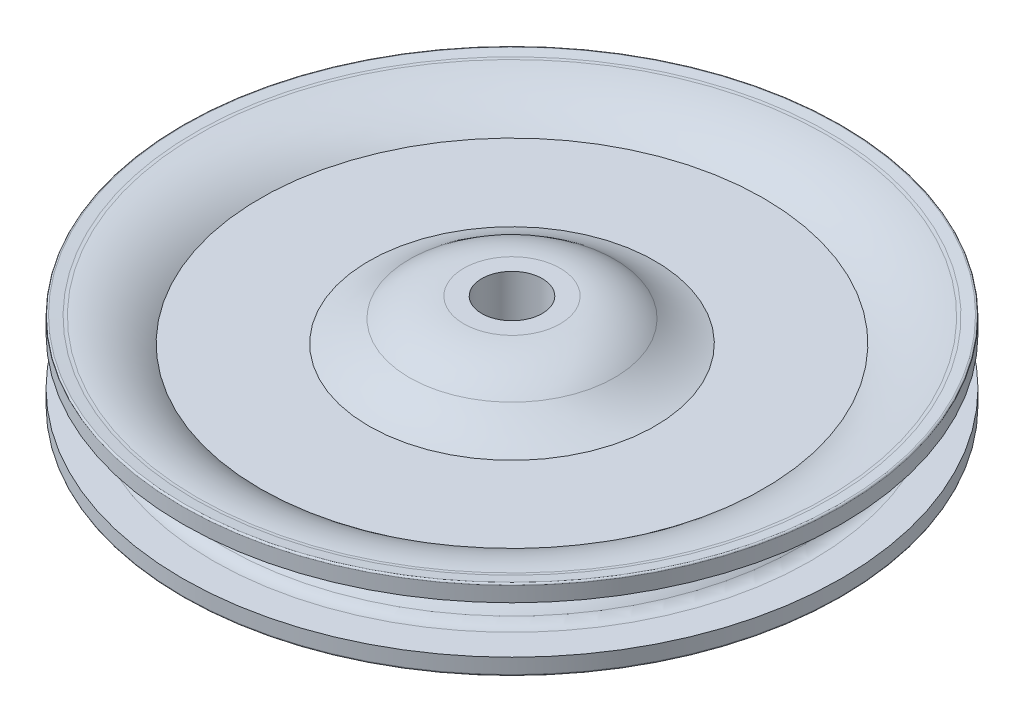
ISO-10303-21;
HEADER;
FILE_DESCRIPTION(('STEP AP214'),'2;1');
FILE_NAME('part.step','',(''),(''),'','','');
FILE_SCHEMA(('AUTOMOTIVE_DESIGN { 1 0 10303 214 1 1 1 1 }'));
ENDSEC;
DATA;
#1=APPLICATION_CONTEXT('core data for automotive mechanical design processes');
#2=APPLICATION_PROTOCOL_DEFINITION('international standard','automotive_design',2000,#1);
#3=PRODUCT_CONTEXT('',#1,'mechanical');
#4=PRODUCT('Part','Part','',(#3));
#5=PRODUCT_RELATED_PRODUCT_CATEGORY('part','',(#4));
#6=PRODUCT_DEFINITION_FORMATION('','',#4);
#7=PRODUCT_DEFINITION_CONTEXT('part definition',#1,'design');
#8=PRODUCT_DEFINITION('design','',#6,#7);
#9=PRODUCT_DEFINITION_SHAPE('','',#8);
#10=(LENGTH_UNIT() NAMED_UNIT(*) SI_UNIT(.MILLI.,.METRE.));
#11=(NAMED_UNIT(*) PLANE_ANGLE_UNIT() SI_UNIT($,.RADIAN.));
#12=(NAMED_UNIT(*) SI_UNIT($,.STERADIAN.) SOLID_ANGLE_UNIT());
#13=UNCERTAINTY_MEASURE_WITH_UNIT(LENGTH_MEASURE(1.E-05),#10,'distance_accuracy_value','');
#14=(GEOMETRIC_REPRESENTATION_CONTEXT(3) GLOBAL_UNCERTAINTY_ASSIGNED_CONTEXT((#13)) GLOBAL_UNIT_ASSIGNED_CONTEXT((#10,
#11,#12)) REPRESENTATION_CONTEXT('',''));
#15=CARTESIAN_POINT('',(0.,0.,0.));
#16=DIRECTION('',(0.,0.,1.));
#17=DIRECTION('',(1.,0.,0.));
#18=AXIS2_PLACEMENT_3D('',#15,#16,#17);
#19=CARTESIAN_POINT('',(0.,4.86042079778806,0.));
#20=DIRECTION('',(0.,1.,0.));
#21=DIRECTION('',(0.,0.,1.));
#22=AXIS2_PLACEMENT_3D('',#19,#20,#21);
#23=DEGENERATE_TOROIDAL_SURFACE('',#22,7.89305000000001,14.0742707977881,.T.);
#24=CARTESIAN_POINT('',(0.,-6.03517127364018,0.));
#25=DIRECTION('',(0.,1.,0.));
#26=DIRECTION('',(0.,0.,1.));
#27=AXIS2_PLACEMENT_3D('',#24,#25,#26);
#28=CIRCLE('',#27,16.8021);
#29=CARTESIAN_POINT('',(0.,-6.03517127364018,16.8021));
#30=VERTEX_POINT('',#29);
#31=EDGE_CURVE('E10',#30,#30,#28,.T.);
#32=ORIENTED_EDGE('',*,*,#31,.F.);
#33=EDGE_LOOP('',(#32));
#34=FACE_BOUND('',#33,.T.);
#35=CARTESIAN_POINT('',(0.,-9.21385,0.));
#36=DIRECTION('',(0.,1.,0.));
#37=DIRECTION('',(0.,0.,1.));
#38=AXIS2_PLACEMENT_3D('',#35,#36,#37);
#39=CIRCLE('',#38,7.89305000000001);
#40=CARTESIAN_POINT('',(0.,-9.21385,7.89305000000001));
#41=VERTEX_POINT('',#40);
#42=EDGE_CURVE('E106',#41,#41,#39,.T.);
#43=ORIENTED_EDGE('',*,*,#42,.T.);
#44=EDGE_LOOP('',(#43));
#45=FACE_BOUND('',#44,.T.);
#46=ADVANCED_FACE('F30',(#34,#45),#23,.T.);
#47=CARTESIAN_POINT('',(0.,-21.2372215088753,0.));
#48=DIRECTION('',(0.,1.,0.));
#49=DIRECTION('',(0.,0.,1.));
#50=AXIS2_PLACEMENT_3D('',#47,#48,#49);
#51=TOROIDAL_SURFACE('',#50,29.2324318957194,19.6370945506801);
#52=CARTESIAN_POINT('',(0.,-2.4765,0.));
#53=DIRECTION('',(0.,1.,0.));
#54=DIRECTION('',(0.,0.,1.));
#55=AXIS2_PLACEMENT_3D('',#52,#53,#54);
#56=CIRCLE('',#55,23.4315);
#57=CARTESIAN_POINT('',(0.,-2.4765,23.4315));
#58=VERTEX_POINT('',#57);
#59=EDGE_CURVE('E36',#58,#58,#56,.T.);
#60=ORIENTED_EDGE('',*,*,#59,.F.);
#61=EDGE_LOOP('',(#60));
#62=FACE_BOUND('',#61,.T.);
#63=ORIENTED_EDGE('',*,*,#31,.T.);
#64=EDGE_LOOP('',(#63));
#65=FACE_BOUND('',#64,.T.);
#66=ADVANCED_FACE('F239',(#62,#65),#51,.F.);
#67=CARTESIAN_POINT('',(23.4315,-2.4765,0.));
#68=DIRECTION('',(0.,1.,0.));
#69=DIRECTION('',(0.,0.,1.));
#70=AXIS2_PLACEMENT_3D('',#67,#68,#69);
#71=PLANE('',#70);
#72=CARTESIAN_POINT('',(0.,-2.47650000000001,0.));
#73=DIRECTION('',(0.,1.,0.));
#74=DIRECTION('',(0.,0.,1.));
#75=AXIS2_PLACEMENT_3D('',#72,#73,#74);
#76=CIRCLE('',#75,41.2115);
#77=CARTESIAN_POINT('',(0.,-2.47650000000001,41.2115));
#78=VERTEX_POINT('',#77);
#79=EDGE_CURVE('E40',#78,#78,#76,.T.);
#80=ORIENTED_EDGE('',*,*,#79,.F.);
#81=EDGE_LOOP('',(#80));
#82=FACE_BOUND('',#81,.T.);
#83=ORIENTED_EDGE('',*,*,#59,.T.);
#84=EDGE_LOOP('',(#83));
#85=FACE_BOUND('',#84,.T.);
#86=ADVANCED_FACE('F234',(#82,#85),#71,.F.);
#87=CARTESIAN_POINT('',(0.,9.86038409836064,0.));
#88=DIRECTION('',(0.,1.,0.));
#89=DIRECTION('',(0.,0.,1.));
#90=AXIS2_PLACEMENT_3D('',#87,#88,#89);
#91=TOROIDAL_SURFACE('',#90,51.7271,16.2103840983606);
#92=CARTESIAN_POINT('',(0.,-6.35,0.));
#93=DIRECTION('',(0.,1.,0.));
#94=DIRECTION('',(0.,0.,1.));
#95=AXIS2_PLACEMENT_3D('',#92,#93,#94);
#96=CIRCLE('',#95,51.7271);
#97=CARTESIAN_POINT('',(0.,-6.35,51.7271));
#98=VERTEX_POINT('',#97);
#99=EDGE_CURVE('E44',#98,#98,#96,.T.);
#100=ORIENTED_EDGE('',*,*,#99,.F.);
#101=EDGE_LOOP('',(#100));
#102=FACE_BOUND('',#101,.T.);
#103=ORIENTED_EDGE('',*,*,#79,.T.);
#104=EDGE_LOOP('',(#103));
#105=FACE_BOUND('',#104,.T.);
#106=ADVANCED_FACE('F228',(#102,#105),#91,.T.);
#107=CARTESIAN_POINT('',(0.,-6.35,0.));
#108=DIRECTION('',(0.,-1.,0.));
#109=DIRECTION('',(0.,0.,-1.));
#110=AXIS2_PLACEMENT_3D('',#107,#108,#109);
#111=CONICAL_SURFACE('',#110,51.7271,1.45764534520441);
#112=CARTESIAN_POINT('',(0.,-6.57187737945872,0.));
#113=DIRECTION('',(0.,1.,0.));
#114=DIRECTION('',(0.,0.,1.));
#115=AXIS2_PLACEMENT_3D('',#112,#113,#114);
#116=CIRCLE('',#115,53.6796209392367);
#117=CARTESIAN_POINT('',(0.,-6.57187737945872,53.6796209392367));
#118=VERTEX_POINT('',#117);
#119=EDGE_CURVE('E49',#118,#118,#116,.T.);
#120=ORIENTED_EDGE('',*,*,#119,.F.);
#121=EDGE_LOOP('',(#120));
#122=FACE_BOUND('',#121,.T.);
#123=ORIENTED_EDGE('',*,*,#99,.T.);
#124=EDGE_LOOP('',(#123));
#125=FACE_BOUND('',#124,.T.);
#126=ADVANCED_FACE('F222',(#122,#125),#111,.F.);
#127=CARTESIAN_POINT('',(0.,-6.31950164474213,0.));
#128=DIRECTION('',(0.,1.,0.));
#129=DIRECTION('',(0.,0.,1.));
#130=AXIS2_PLACEMENT_3D('',#127,#128,#129);
#131=TOROIDAL_SURFACE('',#130,53.7083,0.253999999999999);
#132=CARTESIAN_POINT('',(0.,-6.31950164474213,0.));
#133=DIRECTION('',(0.,1.,0.));
#134=DIRECTION('',(0.,0.,1.));
#135=AXIS2_PLACEMENT_3D('',#132,#133,#134);
#136=CIRCLE('',#135,53.9623);
#137=CARTESIAN_POINT('',(0.,-6.31950164474213,53.9623));
#138=VERTEX_POINT('',#137);
#139=EDGE_CURVE('E52',#138,#138,#136,.T.);
#140=ORIENTED_EDGE('',*,*,#139,.F.);
#141=EDGE_LOOP('',(#140));
#142=FACE_BOUND('',#141,.T.);
#143=ORIENTED_EDGE('',*,*,#119,.T.);
#144=EDGE_LOOP('',(#143));
#145=FACE_BOUND('',#144,.T.);
#146=ADVANCED_FACE('F216',(#142,#145),#131,.T.);
#147=CARTESIAN_POINT('',(0.,28.5753023809525,0.));
#148=DIRECTION('',(0.,1.,0.));
#149=DIRECTION('',(0.,0.,1.));
#150=AXIS2_PLACEMENT_3D('',#147,#148,#149);
#151=CYLINDRICAL_SURFACE('',#150,53.9623);
#152=CARTESIAN_POINT('',(0.,-3.8608,0.));
#153=DIRECTION('',(0.,1.,0.));
#154=DIRECTION('',(0.,0.,1.));
#155=AXIS2_PLACEMENT_3D('',#152,#153,#154);
#156=CIRCLE('',#155,53.9623);
#157=CARTESIAN_POINT('',(0.,-3.8608,53.9623));
#158=VERTEX_POINT('',#157);
#159=EDGE_CURVE('E55',#158,#158,#156,.T.);
#160=ORIENTED_EDGE('',*,*,#159,.F.);
#161=EDGE_LOOP('',(#160));
#162=FACE_BOUND('',#161,.T.);
#163=ORIENTED_EDGE('',*,*,#139,.T.);
#164=EDGE_LOOP('',(#163));
#165=FACE_BOUND('',#164,.T.);
#166=ADVANCED_FACE('F210',(#162,#165),#151,.T.);
#167=CARTESIAN_POINT('',(48.9656795702502,-3.8608,0.));
#168=DIRECTION('',(0.,-1.,0.));
#169=DIRECTION('',(0.,0.,-1.));
#170=AXIS2_PLACEMENT_3D('',#167,#168,#169);
#171=PLANE('',#170);
#172=CARTESIAN_POINT('',(0.,-3.8608,0.));
#173=DIRECTION('',(0.,1.,0.));
#174=DIRECTION('',(0.,0.,1.));
#175=AXIS2_PLACEMENT_3D('',#172,#173,#174);
#176=CIRCLE('',#175,48.9656795702502);
#177=CARTESIAN_POINT('',(0.,-3.8608,48.9656795702502));
#178=VERTEX_POINT('',#177);
#179=EDGE_CURVE('E58',#178,#178,#176,.T.);
#180=ORIENTED_EDGE('',*,*,#179,.F.);
#181=EDGE_LOOP('',(#180));
#182=FACE_BOUND('',#181,.T.);
#183=ORIENTED_EDGE('',*,*,#159,.T.);
#184=EDGE_LOOP('',(#183));
#185=FACE_BOUND('',#184,.T.);
#186=ADVANCED_FACE('F204',(#182,#185),#171,.F.);
#187=CARTESIAN_POINT('',(0.,-1.3208,0.));
#188=DIRECTION('',(0.,1.,0.));
#189=DIRECTION('',(0.,0.,1.));
#190=AXIS2_PLACEMENT_3D('',#187,#188,#189);
#191=TOROIDAL_SURFACE('',#190,48.9656795702502,2.54);
#192=CARTESIAN_POINT('',(0.,-2.94191473244687,0.));
#193=DIRECTION('',(0.,1.,0.));
#194=DIRECTION('',(0.,0.,1.));
#195=AXIS2_PLACEMENT_3D('',#192,#193,#194);
#196=CIRCLE('',#195,47.0102801163678);
#197=CARTESIAN_POINT('',(0.,-2.94191473244687,47.0102801163678));
#198=VERTEX_POINT('',#197);
#199=EDGE_CURVE('E61',#198,#198,#196,.T.);
#200=ORIENTED_EDGE('',*,*,#199,.F.);
#201=EDGE_LOOP('',(#200));
#202=FACE_BOUND('',#201,.T.);
#203=ORIENTED_EDGE('',*,*,#179,.T.);
#204=EDGE_LOOP('',(#203));
#205=FACE_BOUND('',#204,.T.);
#206=ADVANCED_FACE('F198',(#202,#205),#191,.F.);
#207=CARTESIAN_POINT('',(0.,-11.5986759796967,0.));
#208=DIRECTION('',(0.,1.,0.));
#209=DIRECTION('',(0.,0.,1.));
#210=AXIS2_PLACEMENT_3D('',#207,#208,#209);
#211=TOROIDAL_SURFACE('',#210,36.5684366882268,13.563613437049);
#212=CARTESIAN_POINT('',(0.,0.,0.));
#213=DIRECTION('',(0.,1.,0.));
#214=DIRECTION('',(0.,0.,1.));
#215=AXIS2_PLACEMENT_3D('',#212,#213,#214);
#216=CIRCLE('',#215,43.5999603486936);
#217=CARTESIAN_POINT('',(0.,0.,43.5999603486936));
#218=VERTEX_POINT('',#217);
#219=EDGE_CURVE('E64',#218,#218,#216,.T.);
#220=ORIENTED_EDGE('',*,*,#219,.F.);
#221=EDGE_LOOP('',(#220));
#222=FACE_BOUND('',#221,.T.);
#223=ORIENTED_EDGE('',*,*,#199,.T.);
#224=EDGE_LOOP('',(#223));
#225=FACE_BOUND('',#224,.T.);
#226=ADVANCED_FACE('F192',(#222,#225),#211,.T.);
#227=CARTESIAN_POINT('',(0.,11.5986759796967,0.));
#228=DIRECTION('',(0.,1.,0.));
#229=DIRECTION('',(0.,0.,1.));
#230=AXIS2_PLACEMENT_3D('',#227,#228,#229);
#231=TOROIDAL_SURFACE('',#230,36.5684366882268,13.563613437049);
#232=CARTESIAN_POINT('',(0.,2.94191473244687,0.));
#233=DIRECTION('',(0.,1.,0.));
#234=DIRECTION('',(0.,0.,1.));
#235=AXIS2_PLACEMENT_3D('',#232,#233,#234);
#236=CIRCLE('',#235,47.0102801163678);
#237=CARTESIAN_POINT('',(0.,2.94191473244687,47.0102801163678));
#238=VERTEX_POINT('',#237);
#239=EDGE_CURVE('E67',#238,#238,#236,.T.);
#240=ORIENTED_EDGE('',*,*,#239,.F.);
#241=EDGE_LOOP('',(#240));
#242=FACE_BOUND('',#241,.T.);
#243=ORIENTED_EDGE('',*,*,#219,.T.);
#244=EDGE_LOOP('',(#243));
#245=FACE_BOUND('',#244,.T.);
#246=ADVANCED_FACE('F186',(#242,#245),#231,.T.);
#247=CARTESIAN_POINT('',(0.,1.3208,0.));
#248=DIRECTION('',(0.,1.,0.));
#249=DIRECTION('',(0.,0.,1.));
#250=AXIS2_PLACEMENT_3D('',#247,#248,#249);
#251=TOROIDAL_SURFACE('',#250,48.9656795702502,2.54);
#252=CARTESIAN_POINT('',(0.,3.8608,0.));
#253=DIRECTION('',(0.,1.,0.));
#254=DIRECTION('',(0.,0.,1.));
#255=AXIS2_PLACEMENT_3D('',#252,#253,#254);
#256=CIRCLE('',#255,48.9656795702502);
#257=CARTESIAN_POINT('',(0.,3.8608,48.9656795702502));
#258=VERTEX_POINT('',#257);
#259=EDGE_CURVE('E70',#258,#258,#256,.T.);
#260=ORIENTED_EDGE('',*,*,#259,.F.);
#261=EDGE_LOOP('',(#260));
#262=FACE_BOUND('',#261,.T.);
#263=ORIENTED_EDGE('',*,*,#239,.T.);
#264=EDGE_LOOP('',(#263));
#265=FACE_BOUND('',#264,.T.);
#266=ADVANCED_FACE('F180',(#262,#265),#251,.F.);
#267=CARTESIAN_POINT('',(53.9623,3.8608,0.));
#268=DIRECTION('',(0.,1.,0.));
#269=DIRECTION('',(0.,0.,1.));
#270=AXIS2_PLACEMENT_3D('',#267,#268,#269);
#271=PLANE('',#270);
#272=CARTESIAN_POINT('',(0.,3.8608,0.));
#273=DIRECTION('',(0.,1.,0.));
#274=DIRECTION('',(0.,0.,1.));
#275=AXIS2_PLACEMENT_3D('',#272,#273,#274);
#276=CIRCLE('',#275,53.9623);
#277=CARTESIAN_POINT('',(0.,3.8608,53.9623));
#278=VERTEX_POINT('',#277);
#279=EDGE_CURVE('E73',#278,#278,#276,.T.);
#280=ORIENTED_EDGE('',*,*,#279,.F.);
#281=EDGE_LOOP('',(#280));
#282=FACE_BOUND('',#281,.T.);
#283=ORIENTED_EDGE('',*,*,#259,.T.);
#284=EDGE_LOOP('',(#283));
#285=FACE_BOUND('',#284,.T.);
#286=ADVANCED_FACE('F174',(#282,#285),#271,.F.);
#287=CARTESIAN_POINT('',(0.,28.5753023809525,0.));
#288=DIRECTION('',(0.,1.,0.));
#289=DIRECTION('',(0.,0.,1.));
#290=AXIS2_PLACEMENT_3D('',#287,#288,#289);
#291=CYLINDRICAL_SURFACE('',#290,53.9623);
#292=CARTESIAN_POINT('',(0.,6.31950164474213,0.));
#293=DIRECTION('',(0.,1.,0.));
#294=DIRECTION('',(0.,0.,1.));
#295=AXIS2_PLACEMENT_3D('',#292,#293,#294);
#296=CIRCLE('',#295,53.9623);
#297=CARTESIAN_POINT('',(0.,6.31950164474213,53.9623));
#298=VERTEX_POINT('',#297);
#299=EDGE_CURVE('E76',#298,#298,#296,.T.);
#300=ORIENTED_EDGE('',*,*,#299,.F.);
#301=EDGE_LOOP('',(#300));
#302=FACE_BOUND('',#301,.T.);
#303=ORIENTED_EDGE('',*,*,#279,.T.);
#304=EDGE_LOOP('',(#303));
#305=FACE_BOUND('',#304,.T.);
#306=ADVANCED_FACE('F168',(#302,#305),#291,.T.);
#307=CARTESIAN_POINT('',(0.,6.31950164474213,0.));
#308=DIRECTION('',(0.,1.,0.));
#309=DIRECTION('',(0.,0.,1.));
#310=AXIS2_PLACEMENT_3D('',#307,#308,#309);
#311=TOROIDAL_SURFACE('',#310,53.7083,0.253999999999999);
#312=CARTESIAN_POINT('',(0.,6.57187737945872,0.));
#313=DIRECTION('',(0.,1.,0.));
#314=DIRECTION('',(0.,0.,1.));
#315=AXIS2_PLACEMENT_3D('',#312,#313,#314);
#316=CIRCLE('',#315,53.6796209392367);
#317=CARTESIAN_POINT('',(0.,6.57187737945872,53.6796209392367));
#318=VERTEX_POINT('',#317);
#319=EDGE_CURVE('E79',#318,#318,#316,.T.);
#320=ORIENTED_EDGE('',*,*,#319,.F.);
#321=EDGE_LOOP('',(#320));
#322=FACE_BOUND('',#321,.T.);
#323=ORIENTED_EDGE('',*,*,#299,.T.);
#324=EDGE_LOOP('',(#323));
#325=FACE_BOUND('',#324,.T.);
#326=ADVANCED_FACE('F162',(#322,#325),#311,.T.);
#327=CARTESIAN_POINT('',(0.,6.57187737945872,0.));
#328=DIRECTION('',(0.,1.,0.));
#329=DIRECTION('',(0.,0.,1.));
#330=AXIS2_PLACEMENT_3D('',#327,#328,#329);
#331=CONICAL_SURFACE('',#330,53.6796209392367,1.45764534520441);
#332=CARTESIAN_POINT('',(0.,6.38026864042208,0.));
#333=DIRECTION('',(0.,1.,0.));
#334=DIRECTION('',(0.,0.,1.));
#335=AXIS2_PLACEMENT_3D('',#332,#333,#334);
#336=CIRCLE('',#335,51.9934640357144);
#337=CARTESIAN_POINT('',(0.,6.38026864042208,51.9934640357144));
#338=VERTEX_POINT('',#337);
#339=EDGE_CURVE('E82',#338,#338,#336,.T.);
#340=ORIENTED_EDGE('',*,*,#339,.F.);
#341=EDGE_LOOP('',(#340));
#342=FACE_BOUND('',#341,.T.);
#343=ORIENTED_EDGE('',*,*,#319,.T.);
#344=EDGE_LOOP('',(#343));
#345=FACE_BOUND('',#344,.T.);
#346=ADVANCED_FACE('F156',(#342,#345),#331,.F.);
#347=CARTESIAN_POINT('',(0.,11.4277833347539,0.));
#348=DIRECTION('',(0.,1.,0.));
#349=DIRECTION('',(0.,0.,1.));
#350=AXIS2_PLACEMENT_3D('',#347,#348,#349);
#351=TOROIDAL_SURFACE('',#350,51.4198828204494,5.08);
#352=CARTESIAN_POINT('',(0.,6.34831224298765,0.));
#353=DIRECTION('',(0.,1.,0.));
#354=DIRECTION('',(0.,0.,1.));
#355=AXIS2_PLACEMENT_3D('',#352,#353,#354);
#356=CIRCLE('',#355,51.4931864896038);
#357=CARTESIAN_POINT('',(0.,6.34831224298765,51.4931864896038));
#358=VERTEX_POINT('',#357);
#359=EDGE_CURVE('E85',#358,#358,#356,.T.);
#360=ORIENTED_EDGE('',*,*,#359,.F.);
#361=EDGE_LOOP('',(#360));
#362=FACE_BOUND('',#361,.T.);
#363=ORIENTED_EDGE('',*,*,#339,.T.);
#364=EDGE_LOOP('',(#363));
#365=FACE_BOUND('',#364,.T.);
#366=ADVANCED_FACE('F150',(#362,#365),#351,.F.);
#367=CARTESIAN_POINT('',(0.,-9.86038409836064,0.));
#368=DIRECTION('',(0.,1.,0.));
#369=DIRECTION('',(0.,0.,1.));
#370=AXIS2_PLACEMENT_3D('',#367,#368,#369);
#371=TOROIDAL_SURFACE('',#370,51.7271,16.2103840983606);
#372=CARTESIAN_POINT('',(0.,2.4765,0.));
#373=DIRECTION('',(0.,1.,0.));
#374=DIRECTION('',(0.,0.,1.));
#375=AXIS2_PLACEMENT_3D('',#372,#373,#374);
#376=CIRCLE('',#375,41.2115);
#377=CARTESIAN_POINT('',(0.,2.4765,41.2115));
#378=VERTEX_POINT('',#377);
#379=EDGE_CURVE('E88',#378,#378,#376,.T.);
#380=ORIENTED_EDGE('',*,*,#379,.F.);
#381=EDGE_LOOP('',(#380));
#382=FACE_BOUND('',#381,.T.);
#383=ORIENTED_EDGE('',*,*,#359,.T.);
#384=EDGE_LOOP('',(#383));
#385=FACE_BOUND('',#384,.T.);
#386=ADVANCED_FACE('F144',(#382,#385),#371,.T.);
#387=CARTESIAN_POINT('',(23.4315,2.4765,0.));
#388=DIRECTION('',(0.,-1.,0.));
#389=DIRECTION('',(0.,0.,-1.));
#390=AXIS2_PLACEMENT_3D('',#387,#388,#389);
#391=PLANE('',#390);
#392=CARTESIAN_POINT('',(0.,2.4765,0.));
#393=DIRECTION('',(0.,1.,0.));
#394=DIRECTION('',(0.,0.,1.));
#395=AXIS2_PLACEMENT_3D('',#392,#393,#394);
#396=CIRCLE('',#395,23.4315);
#397=CARTESIAN_POINT('',(0.,2.4765,23.4315));
#398=VERTEX_POINT('',#397);
#399=EDGE_CURVE('E91',#398,#398,#396,.T.);
#400=ORIENTED_EDGE('',*,*,#399,.F.);
#401=EDGE_LOOP('',(#400));
#402=FACE_BOUND('',#401,.T.);
#403=ORIENTED_EDGE('',*,*,#379,.T.);
#404=EDGE_LOOP('',(#403));
#405=FACE_BOUND('',#404,.T.);
#406=ADVANCED_FACE('F138',(#402,#405),#391,.F.);
#407=CARTESIAN_POINT('',(0.,21.2372215088753,0.));
#408=DIRECTION('',(0.,1.,0.));
#409=DIRECTION('',(0.,0.,1.));
#410=AXIS2_PLACEMENT_3D('',#407,#408,#409);
#411=TOROIDAL_SURFACE('',#410,29.2324318957194,19.6370945506801);
#412=CARTESIAN_POINT('',(0.,6.03517127364017,0.));
#413=DIRECTION('',(0.,1.,0.));
#414=DIRECTION('',(0.,0.,1.));
#415=AXIS2_PLACEMENT_3D('',#412,#413,#414);
#416=CIRCLE('',#415,16.8021);
#417=CARTESIAN_POINT('',(0.,6.03517127364017,16.8021));
#418=VERTEX_POINT('',#417);
#419=EDGE_CURVE('E94',#418,#418,#416,.T.);
#420=ORIENTED_EDGE('',*,*,#419,.F.);
#421=EDGE_LOOP('',(#420));
#422=FACE_BOUND('',#421,.T.);
#423=ORIENTED_EDGE('',*,*,#399,.T.);
#424=EDGE_LOOP('',(#423));
#425=FACE_BOUND('',#424,.T.);
#426=ADVANCED_FACE('F132',(#422,#425),#411,.F.);
#427=CARTESIAN_POINT('',(0.,-4.86042079778806,0.));
#428=DIRECTION('',(0.,1.,0.));
#429=DIRECTION('',(0.,0.,1.));
#430=AXIS2_PLACEMENT_3D('',#427,#428,#429);
#431=DEGENERATE_TOROIDAL_SURFACE('',#430,7.89305000000001,14.0742707977881,.T.);
#432=CARTESIAN_POINT('',(0.,9.21385,0.));
#433=DIRECTION('',(0.,1.,0.));
#434=DIRECTION('',(0.,0.,1.));
#435=AXIS2_PLACEMENT_3D('',#432,#433,#434);
#436=CIRCLE('',#435,7.89305000000001);
#437=CARTESIAN_POINT('',(0.,9.21385,7.89305000000001));
#438=VERTEX_POINT('',#437);
#439=EDGE_CURVE('E97',#438,#438,#436,.T.);
#440=ORIENTED_EDGE('',*,*,#439,.F.);
#441=EDGE_LOOP('',(#440));
#442=FACE_BOUND('',#441,.T.);
#443=ORIENTED_EDGE('',*,*,#419,.T.);
#444=EDGE_LOOP('',(#443));
#445=FACE_BOUND('',#444,.T.);
#446=ADVANCED_FACE('F126',(#442,#445),#431,.T.);
#447=CARTESIAN_POINT('',(4.95935000000001,9.21385,0.));
#448=DIRECTION('',(0.,-1.,0.));
#449=DIRECTION('',(0.,0.,-1.));
#450=AXIS2_PLACEMENT_3D('',#447,#448,#449);
#451=PLANE('',#450);
#452=CARTESIAN_POINT('',(0.,9.21385,0.));
#453=DIRECTION('',(0.,1.,0.));
#454=DIRECTION('',(0.,0.,1.));
#455=AXIS2_PLACEMENT_3D('',#452,#453,#454);
#456=CIRCLE('',#455,4.95935000000001);
#457=CARTESIAN_POINT('',(0.,9.21385,4.95935000000001));
#458=VERTEX_POINT('',#457);
#459=EDGE_CURVE('E100',#458,#458,#456,.T.);
#460=ORIENTED_EDGE('',*,*,#459,.F.);
#461=EDGE_LOOP('',(#460));
#462=FACE_BOUND('',#461,.T.);
#463=ORIENTED_EDGE('',*,*,#439,.T.);
#464=EDGE_LOOP('',(#463));
#465=FACE_BOUND('',#464,.T.);
#466=ADVANCED_FACE('F120',(#462,#465),#451,.F.);
#467=CARTESIAN_POINT('',(0.,28.5753023809525,0.));
#468=DIRECTION('',(0.,1.,0.));
#469=DIRECTION('',(0.,0.,1.));
#470=AXIS2_PLACEMENT_3D('',#467,#468,#469);
#471=CYLINDRICAL_SURFACE('',#470,4.95935000000001);
#472=CARTESIAN_POINT('',(0.,-9.21385,0.));
#473=DIRECTION('',(0.,1.,0.));
#474=DIRECTION('',(0.,0.,1.));
#475=AXIS2_PLACEMENT_3D('',#472,#473,#474);
#476=CIRCLE('',#475,4.95935000000001);
#477=CARTESIAN_POINT('',(0.,-9.21385,4.95935000000001));
#478=VERTEX_POINT('',#477);
#479=EDGE_CURVE('E103',#478,#478,#476,.T.);
#480=ORIENTED_EDGE('',*,*,#479,.F.);
#481=EDGE_LOOP('',(#480));
#482=FACE_BOUND('',#481,.T.);
#483=ORIENTED_EDGE('',*,*,#459,.T.);
#484=EDGE_LOOP('',(#483));
#485=FACE_BOUND('',#484,.T.);
#486=ADVANCED_FACE('F114',(#482,#485),#471,.F.);
#487=CARTESIAN_POINT('',(4.95935000000001,-9.21385,0.));
#488=DIRECTION('',(0.,1.,0.));
#489=DIRECTION('',(0.,0.,1.));
#490=AXIS2_PLACEMENT_3D('',#487,#488,#489);
#491=PLANE('',#490);
#492=ORIENTED_EDGE('',*,*,#42,.F.);
#493=EDGE_LOOP('',(#492));
#494=FACE_BOUND('',#493,.T.);
#495=ORIENTED_EDGE('',*,*,#479,.T.);
#496=EDGE_LOOP('',(#495));
#497=FACE_BOUND('',#496,.T.);
#498=ADVANCED_FACE('F111',(#494,#497),#491,.F.);
#499=CLOSED_SHELL('',(#46,#66,#86,#106,#126,#146,#166,#186,#206,#226,#246,#266,#286,#306,#326,
#346,#366,#386,#406,#426,#446,#466,#486,#498));
#500=MANIFOLD_SOLID_BREP('B2',#499);
#501=ADVANCED_BREP_SHAPE_REPRESENTATION('',(#18,#500),#14);
#502=SHAPE_DEFINITION_REPRESENTATION(#9,#501);
ENDSEC;
END-ISO-10303-21;
